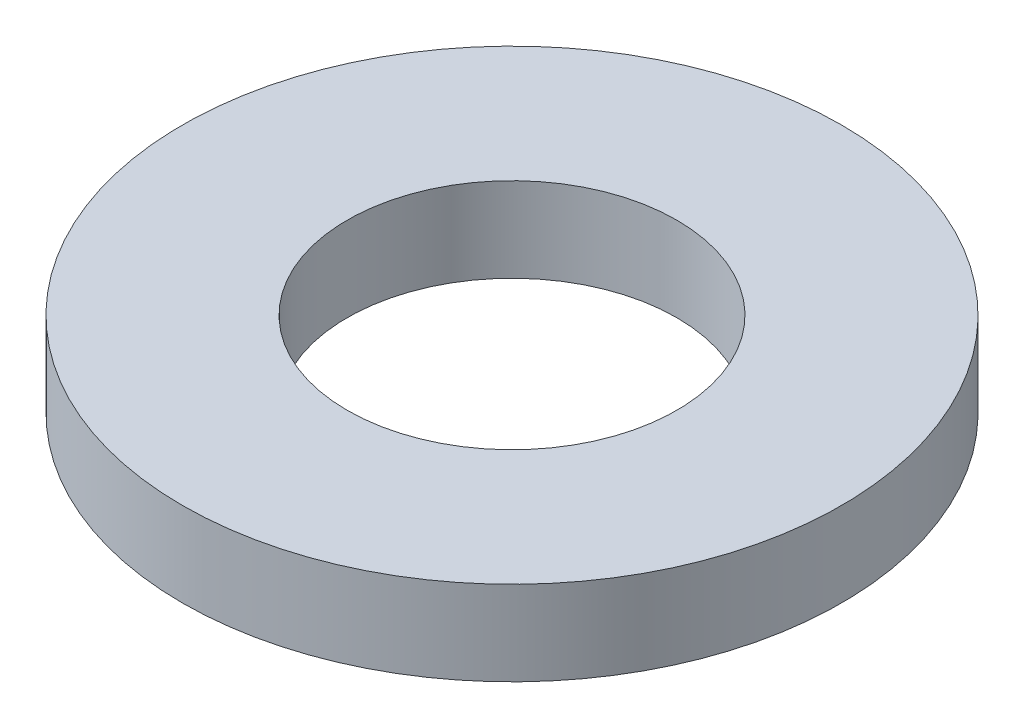
ISO-10303-21;
HEADER;
FILE_DESCRIPTION(('STEP AP214'),'2;1');
FILE_NAME('part.step','',(''),(''),'','','');
FILE_SCHEMA(('AUTOMOTIVE_DESIGN { 1 0 10303 214 1 1 1 1 }'));
ENDSEC;
DATA;
#1=APPLICATION_CONTEXT('core data for automotive mechanical design processes');
#2=APPLICATION_PROTOCOL_DEFINITION('international standard','automotive_design',2000,#1);
#3=PRODUCT_CONTEXT('',#1,'mechanical');
#4=PRODUCT('Part','Part','',(#3));
#5=PRODUCT_RELATED_PRODUCT_CATEGORY('part','',(#4));
#6=PRODUCT_DEFINITION_FORMATION('','',#4);
#7=PRODUCT_DEFINITION_CONTEXT('part definition',#1,'design');
#8=PRODUCT_DEFINITION('design','',#6,#7);
#9=PRODUCT_DEFINITION_SHAPE('','',#8);
#10=(LENGTH_UNIT() NAMED_UNIT(*) SI_UNIT(.MILLI.,.METRE.));
#11=(NAMED_UNIT(*) PLANE_ANGLE_UNIT() SI_UNIT($,.RADIAN.));
#12=(NAMED_UNIT(*) SI_UNIT($,.STERADIAN.) SOLID_ANGLE_UNIT());
#13=UNCERTAINTY_MEASURE_WITH_UNIT(LENGTH_MEASURE(1.E-05),#10,'distance_accuracy_value','');
#14=(GEOMETRIC_REPRESENTATION_CONTEXT(3) GLOBAL_UNCERTAINTY_ASSIGNED_CONTEXT((#13)) GLOBAL_UNIT_ASSIGNED_CONTEXT((#10,
#11,#12)) REPRESENTATION_CONTEXT('',''));
#15=CARTESIAN_POINT('',(0.,0.,0.));
#16=DIRECTION('',(0.,0.,1.));
#17=DIRECTION('',(1.,0.,0.));
#18=AXIS2_PLACEMENT_3D('',#15,#16,#17);
#19=CARTESIAN_POINT('',(0.,0.,0.));
#20=DIRECTION('',(0.,1.,0.));
#21=DIRECTION('',(0.,0.,1.));
#22=AXIS2_PLACEMENT_3D('',#19,#20,#21);
#23=PLANE('',#22);
#24=CARTESIAN_POINT('',(0.,0.,0.));
#25=DIRECTION('',(0.,1.,0.));
#26=DIRECTION('',(0.,0.,1.));
#27=AXIS2_PLACEMENT_3D('',#24,#25,#26);
#28=CIRCLE('',#27,1.9812);
#29=CARTESIAN_POINT('',(0.,0.,1.9812));
#30=VERTEX_POINT('',#29);
#31=EDGE_CURVE('E27',#30,#30,#28,.T.);
#32=ORIENTED_EDGE('',*,*,#31,.T.);
#33=EDGE_LOOP('',(#32));
#34=FACE_BOUND('',#33,.T.);
#35=CARTESIAN_POINT('',(0.,0.,0.));
#36=DIRECTION('',(0.,-1.,0.));
#37=DIRECTION('',(0.,0.,-1.));
#38=AXIS2_PLACEMENT_3D('',#35,#36,#37);
#39=CIRCLE('',#38,3.9624);
#40=CARTESIAN_POINT('',(0.,0.,-3.9624));
#41=VERTEX_POINT('',#40);
#42=EDGE_CURVE('E18',#41,#41,#39,.F.);
#43=ORIENTED_EDGE('',*,*,#42,.F.);
#44=EDGE_LOOP('',(#43));
#45=FACE_BOUND('',#44,.T.);
#46=ADVANCED_FACE('F15',(#34,#45),#23,.F.);
#47=CARTESIAN_POINT('',(0.,1.016,0.));
#48=DIRECTION('',(0.,-1.,0.));
#49=DIRECTION('',(0.,0.,-1.));
#50=AXIS2_PLACEMENT_3D('',#47,#48,#49);
#51=CYLINDRICAL_SURFACE('',#50,3.9624);
#52=CARTESIAN_POINT('',(0.,1.016,0.));
#53=DIRECTION('',(0.,-1.,0.));
#54=DIRECTION('',(0.,0.,-1.));
#55=AXIS2_PLACEMENT_3D('',#52,#53,#54);
#56=CIRCLE('',#55,3.9624);
#57=CARTESIAN_POINT('',(0.,1.016,-3.9624));
#58=VERTEX_POINT('',#57);
#59=EDGE_CURVE('E22',#58,#58,#56,.F.);
#60=ORIENTED_EDGE('',*,*,#59,.F.);
#61=EDGE_LOOP('',(#60));
#62=FACE_BOUND('',#61,.T.);
#63=ORIENTED_EDGE('',*,*,#42,.T.);
#64=EDGE_LOOP('',(#63));
#65=FACE_BOUND('',#64,.T.);
#66=ADVANCED_FACE('F35',(#62,#65),#51,.T.);
#67=CARTESIAN_POINT('',(0.,0.,0.));
#68=DIRECTION('',(0.,1.,0.));
#69=DIRECTION('',(0.,0.,1.));
#70=AXIS2_PLACEMENT_3D('',#67,#68,#69);
#71=CYLINDRICAL_SURFACE('',#70,1.9812);
#72=CARTESIAN_POINT('',(0.,1.016,0.));
#73=DIRECTION('',(0.,1.,0.));
#74=DIRECTION('',(0.,0.,1.));
#75=AXIS2_PLACEMENT_3D('',#72,#73,#74);
#76=CIRCLE('',#75,1.9812);
#77=CARTESIAN_POINT('',(0.,1.016,1.9812));
#78=VERTEX_POINT('',#77);
#79=EDGE_CURVE('E10',#78,#78,#76,.F.);
#80=ORIENTED_EDGE('',*,*,#79,.F.);
#81=EDGE_LOOP('',(#80));
#82=FACE_BOUND('',#81,.T.);
#83=ORIENTED_EDGE('',*,*,#31,.F.);
#84=EDGE_LOOP('',(#83));
#85=FACE_BOUND('',#84,.T.);
#86=ADVANCED_FACE('F42',(#82,#85),#71,.F.);
#87=CARTESIAN_POINT('',(0.,1.016,0.));
#88=DIRECTION('',(0.,1.,0.));
#89=DIRECTION('',(0.,0.,1.));
#90=AXIS2_PLACEMENT_3D('',#87,#88,#89);
#91=PLANE('',#90);
#92=ORIENTED_EDGE('',*,*,#79,.T.);
#93=EDGE_LOOP('',(#92));
#94=FACE_BOUND('',#93,.T.);
#95=ORIENTED_EDGE('',*,*,#59,.T.);
#96=EDGE_LOOP('',(#95));
#97=FACE_BOUND('',#96,.T.);
#98=ADVANCED_FACE('F44',(#94,#97),#91,.T.);
#99=CLOSED_SHELL('',(#46,#66,#86,#98));
#100=MANIFOLD_SOLID_BREP('B1',#99);
#101=ADVANCED_BREP_SHAPE_REPRESENTATION('',(#18,#100),#14);
#102=SHAPE_DEFINITION_REPRESENTATION(#9,#101);
ENDSEC;
END-ISO-10303-21;
